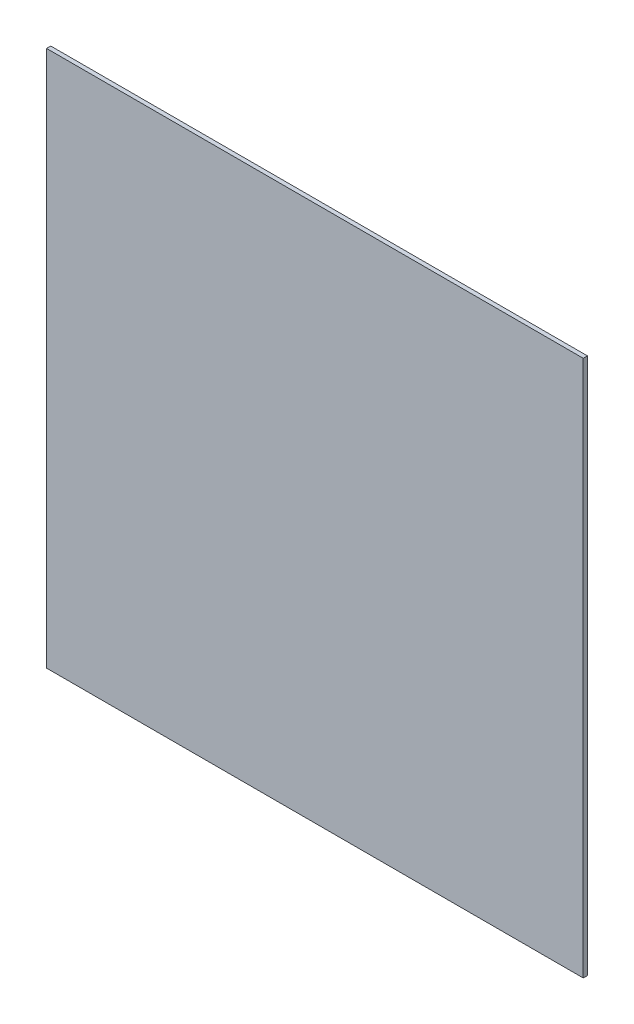
ISO-10303-21;
HEADER;
FILE_DESCRIPTION(('STEP AP214'),'2;1');
FILE_NAME('part.step','',(''),(''),'','','');
FILE_SCHEMA(('AUTOMOTIVE_DESIGN { 1 0 10303 214 1 1 1 1 }'));
ENDSEC;
DATA;
#1=APPLICATION_CONTEXT('core data for automotive mechanical design processes');
#2=APPLICATION_PROTOCOL_DEFINITION('international standard','automotive_design',2000,#1);
#3=PRODUCT_CONTEXT('',#1,'mechanical');
#4=PRODUCT('Part','Part','',(#3));
#5=PRODUCT_RELATED_PRODUCT_CATEGORY('part','',(#4));
#6=PRODUCT_DEFINITION_FORMATION('','',#4);
#7=PRODUCT_DEFINITION_CONTEXT('part definition',#1,'design');
#8=PRODUCT_DEFINITION('design','',#6,#7);
#9=PRODUCT_DEFINITION_SHAPE('','',#8);
#10=(LENGTH_UNIT() NAMED_UNIT(*) SI_UNIT(.MILLI.,.METRE.));
#11=(NAMED_UNIT(*) PLANE_ANGLE_UNIT() SI_UNIT($,.RADIAN.));
#12=(NAMED_UNIT(*) SI_UNIT($,.STERADIAN.) SOLID_ANGLE_UNIT());
#13=UNCERTAINTY_MEASURE_WITH_UNIT(LENGTH_MEASURE(1.E-05),#10,'distance_accuracy_value','');
#14=(GEOMETRIC_REPRESENTATION_CONTEXT(3) GLOBAL_UNCERTAINTY_ASSIGNED_CONTEXT((#13)) GLOBAL_UNIT_ASSIGNED_CONTEXT((#10,
#11,#12)) REPRESENTATION_CONTEXT('',''));
#15=CARTESIAN_POINT('',(0.,0.,0.));
#16=DIRECTION('',(0.,0.,1.));
#17=DIRECTION('',(1.,0.,0.));
#18=AXIS2_PLACEMENT_3D('',#15,#16,#17);
#19=CARTESIAN_POINT('',(0.,0.,9.525));
#20=DIRECTION('',(0.,1.,0.));
#21=DIRECTION('',(0.,0.,1.));
#22=AXIS2_PLACEMENT_3D('',#19,#20,#21);
#23=PLANE('',#22);
#24=DIRECTION('',(1.,0.,0.));
#25=VECTOR('',#24,1.);
#26=CARTESIAN_POINT('',(0.,0.,0.));
#27=LINE('',#26,#25);
#28=CARTESIAN_POINT('',(0.,0.,0.));
#29=VERTEX_POINT('',#28);
#30=CARTESIAN_POINT('',(1219.2,0.,0.));
#31=VERTEX_POINT('',#30);
#32=EDGE_CURVE('E107',#29,#31,#27,.T.);
#33=ORIENTED_EDGE('',*,*,#32,.T.);
#34=DIRECTION('',(0.,0.,-1.));
#35=VECTOR('',#34,1.);
#36=CARTESIAN_POINT('',(1219.2,0.,9.525));
#37=LINE('',#36,#35);
#38=CARTESIAN_POINT('',(1219.2,0.,9.525));
#39=VERTEX_POINT('',#38);
#40=EDGE_CURVE('E11',#39,#31,#37,.T.);
#41=ORIENTED_EDGE('',*,*,#40,.F.);
#42=DIRECTION('',(1.,0.,0.));
#43=VECTOR('',#42,1.);
#44=CARTESIAN_POINT('',(0.,0.,9.525));
#45=LINE('',#44,#43);
#46=CARTESIAN_POINT('',(0.,0.,9.525));
#47=VERTEX_POINT('',#46);
#48=EDGE_CURVE('E91',#47,#39,#45,.T.);
#49=ORIENTED_EDGE('',*,*,#48,.F.);
#50=DIRECTION('',(0.,0.,-1.));
#51=VECTOR('',#50,1.);
#52=CARTESIAN_POINT('',(0.,0.,9.525));
#53=LINE('',#52,#51);
#54=EDGE_CURVE('E103',#47,#29,#53,.T.);
#55=ORIENTED_EDGE('',*,*,#54,.T.);
#56=EDGE_LOOP('',(#33,#41,#49,#55));
#57=FACE_BOUND('',#56,.T.);
#58=ADVANCED_FACE('F39',(#57),#23,.F.);
#59=CARTESIAN_POINT('',(1219.2,0.,9.525));
#60=DIRECTION('',(-1.,0.,0.));
#61=DIRECTION('',(0.,-1.,0.));
#62=AXIS2_PLACEMENT_3D('',#59,#60,#61);
#63=PLANE('',#62);
#64=DIRECTION('',(0.,1.,0.));
#65=VECTOR('',#64,1.);
#66=CARTESIAN_POINT('',(1219.2,0.,0.));
#67=LINE('',#66,#65);
#68=CARTESIAN_POINT('',(1219.2,1219.2,0.));
#69=VERTEX_POINT('',#68);
#70=EDGE_CURVE('E96',#31,#69,#67,.T.);
#71=ORIENTED_EDGE('',*,*,#70,.T.);
#72=DIRECTION('',(0.,0.,-1.));
#73=VECTOR('',#72,1.);
#74=CARTESIAN_POINT('',(1219.2,1219.2,9.525));
#75=LINE('',#74,#73);
#76=CARTESIAN_POINT('',(1219.2,1219.2,9.525));
#77=VERTEX_POINT('',#76);
#78=EDGE_CURVE('E48',#77,#69,#75,.T.);
#79=ORIENTED_EDGE('',*,*,#78,.F.);
#80=DIRECTION('',(0.,1.,0.));
#81=VECTOR('',#80,1.);
#82=CARTESIAN_POINT('',(1219.2,0.,9.525));
#83=LINE('',#82,#81);
#84=EDGE_CURVE('E86',#39,#77,#83,.T.);
#85=ORIENTED_EDGE('',*,*,#84,.F.);
#86=ORIENTED_EDGE('',*,*,#40,.T.);
#87=EDGE_LOOP('',(#71,#79,#85,#86));
#88=FACE_BOUND('',#87,.T.);
#89=ADVANCED_FACE('F95',(#88),#63,.F.);
#90=CARTESIAN_POINT('',(1219.2,1219.2,9.525));
#91=DIRECTION('',(0.,-1.,0.));
#92=DIRECTION('',(1.,0.,0.));
#93=AXIS2_PLACEMENT_3D('',#90,#91,#92);
#94=PLANE('',#93);
#95=DIRECTION('',(-1.,0.,0.));
#96=VECTOR('',#95,1.);
#97=CARTESIAN_POINT('',(1219.2,1219.2,0.));
#98=LINE('',#97,#96);
#99=CARTESIAN_POINT('',(0.,1219.2,0.));
#100=VERTEX_POINT('',#99);
#101=EDGE_CURVE('E73',#69,#100,#98,.T.);
#102=ORIENTED_EDGE('',*,*,#101,.T.);
#103=DIRECTION('',(0.,0.,-1.));
#104=VECTOR('',#103,1.);
#105=CARTESIAN_POINT('',(0.,1219.2,9.525));
#106=LINE('',#105,#104);
#107=CARTESIAN_POINT('',(0.,1219.2,9.525));
#108=VERTEX_POINT('',#107);
#109=EDGE_CURVE('E98',#108,#100,#106,.T.);
#110=ORIENTED_EDGE('',*,*,#109,.F.);
#111=DIRECTION('',(-1.,0.,0.));
#112=VECTOR('',#111,1.);
#113=CARTESIAN_POINT('',(1219.2,1219.2,9.525));
#114=LINE('',#113,#112);
#115=EDGE_CURVE('E89',#77,#108,#114,.T.);
#116=ORIENTED_EDGE('',*,*,#115,.F.);
#117=ORIENTED_EDGE('',*,*,#78,.T.);
#118=EDGE_LOOP('',(#102,#110,#116,#117));
#119=FACE_BOUND('',#118,.T.);
#120=ADVANCED_FACE('F99',(#119),#94,.F.);
#121=CARTESIAN_POINT('',(0.,0.,9.525));
#122=DIRECTION('',(1.,0.,0.));
#123=DIRECTION('',(0.,0.,-1.));
#124=AXIS2_PLACEMENT_3D('',#121,#122,#123);
#125=PLANE('',#124);
#126=DIRECTION('',(0.,-1.,0.));
#127=VECTOR('',#126,1.);
#128=CARTESIAN_POINT('',(0.,0.,0.));
#129=LINE('',#128,#127);
#130=EDGE_CURVE('E79',#100,#29,#129,.T.);
#131=ORIENTED_EDGE('',*,*,#130,.T.);
#132=ORIENTED_EDGE('',*,*,#54,.F.);
#133=DIRECTION('',(0.,-1.,0.));
#134=VECTOR('',#133,1.);
#135=CARTESIAN_POINT('',(0.,0.,9.525));
#136=LINE('',#135,#134);
#137=EDGE_CURVE('E56',#108,#47,#136,.T.);
#138=ORIENTED_EDGE('',*,*,#137,.F.);
#139=ORIENTED_EDGE('',*,*,#109,.T.);
#140=EDGE_LOOP('',(#131,#132,#138,#139));
#141=FACE_BOUND('',#140,.T.);
#142=ADVANCED_FACE('F120',(#141),#125,.F.);
#143=CARTESIAN_POINT('',(0.,0.,9.525));
#144=DIRECTION('',(0.,0.,1.));
#145=DIRECTION('',(1.,0.,0.));
#146=AXIS2_PLACEMENT_3D('',#143,#144,#145);
#147=PLANE('',#146);
#148=ORIENTED_EDGE('',*,*,#48,.T.);
#149=ORIENTED_EDGE('',*,*,#84,.T.);
#150=ORIENTED_EDGE('',*,*,#115,.T.);
#151=ORIENTED_EDGE('',*,*,#137,.T.);
#152=EDGE_LOOP('',(#148,#149,#150,#151));
#153=FACE_BOUND('',#152,.T.);
#154=ADVANCED_FACE('F87',(#153),#147,.T.);
#155=CARTESIAN_POINT('',(0.,0.,0.));
#156=DIRECTION('',(0.,0.,1.));
#157=DIRECTION('',(1.,0.,0.));
#158=AXIS2_PLACEMENT_3D('',#155,#156,#157);
#159=PLANE('',#158);
#160=ORIENTED_EDGE('',*,*,#32,.F.);
#161=ORIENTED_EDGE('',*,*,#130,.F.);
#162=ORIENTED_EDGE('',*,*,#101,.F.);
#163=ORIENTED_EDGE('',*,*,#70,.F.);
#164=EDGE_LOOP('',(#160,#161,#162,#163));
#165=FACE_BOUND('',#164,.T.);
#166=ADVANCED_FACE('F123',(#165),#159,.F.);
#167=CLOSED_SHELL('',(#58,#89,#120,#142,#154,#166));
#168=MANIFOLD_SOLID_BREP('B2',#167);
#169=ADVANCED_BREP_SHAPE_REPRESENTATION('',(#18,#168),#14);
#170=SHAPE_DEFINITION_REPRESENTATION(#9,#169);
ENDSEC;
END-ISO-10303-21;
